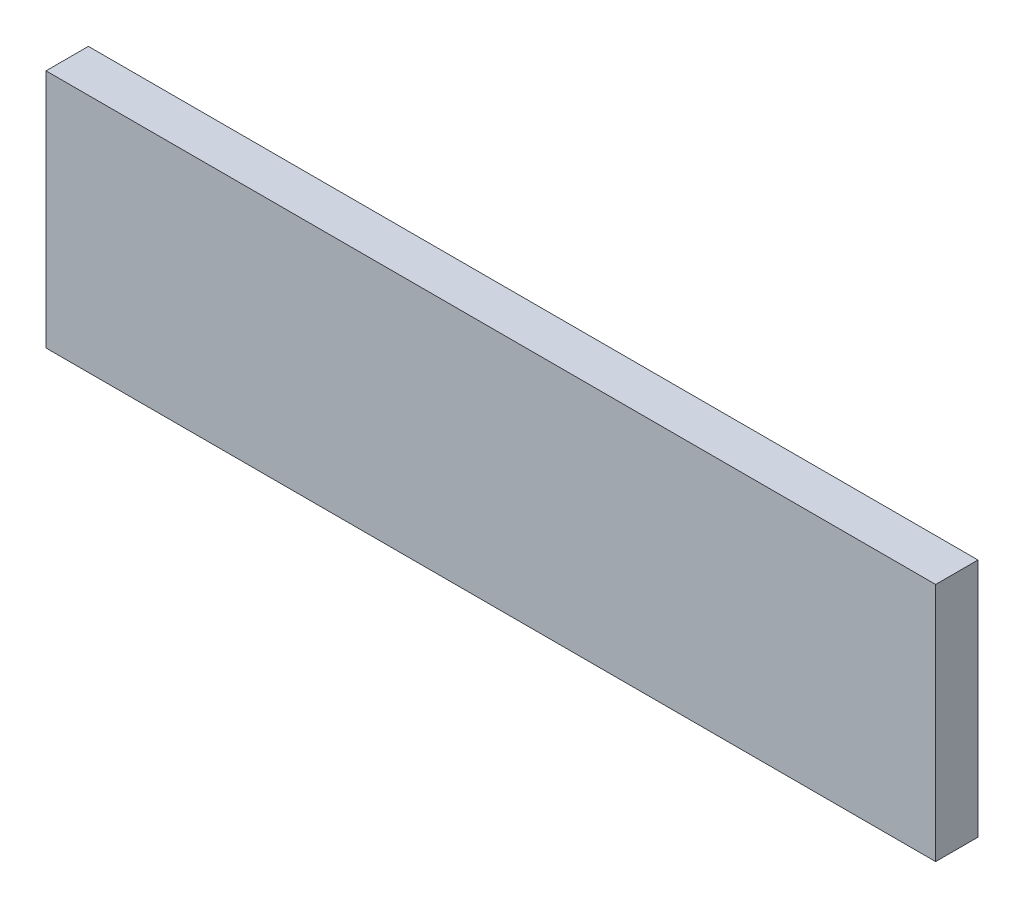
ISO-10303-21;
HEADER;
FILE_DESCRIPTION(('STEP AP214'),'2;1');
FILE_NAME('part.step','',(''),(''),'','','');
FILE_SCHEMA(('AUTOMOTIVE_DESIGN { 1 0 10303 214 1 1 1 1 }'));
ENDSEC;
DATA;
#1=APPLICATION_CONTEXT('core data for automotive mechanical design processes');
#2=APPLICATION_PROTOCOL_DEFINITION('international standard','automotive_design',2000,#1);
#3=PRODUCT_CONTEXT('',#1,'mechanical');
#4=PRODUCT('Part','Part','',(#3));
#5=PRODUCT_RELATED_PRODUCT_CATEGORY('part','',(#4));
#6=PRODUCT_DEFINITION_FORMATION('','',#4);
#7=PRODUCT_DEFINITION_CONTEXT('part definition',#1,'design');
#8=PRODUCT_DEFINITION('design','',#6,#7);
#9=PRODUCT_DEFINITION_SHAPE('','',#8);
#10=(LENGTH_UNIT() NAMED_UNIT(*) SI_UNIT(.MILLI.,.METRE.));
#11=(NAMED_UNIT(*) PLANE_ANGLE_UNIT() SI_UNIT($,.RADIAN.));
#12=(NAMED_UNIT(*) SI_UNIT($,.STERADIAN.) SOLID_ANGLE_UNIT());
#13=UNCERTAINTY_MEASURE_WITH_UNIT(LENGTH_MEASURE(1.E-05),#10,'distance_accuracy_value','');
#14=(GEOMETRIC_REPRESENTATION_CONTEXT(3) GLOBAL_UNCERTAINTY_ASSIGNED_CONTEXT((#13)) GLOBAL_UNIT_ASSIGNED_CONTEXT((#10,
#11,#12)) REPRESENTATION_CONTEXT('',''));
#15=CARTESIAN_POINT('',(0.,0.,0.));
#16=DIRECTION('',(0.,0.,1.));
#17=DIRECTION('',(1.,0.,0.));
#18=AXIS2_PLACEMENT_3D('',#15,#16,#17);
#19=CARTESIAN_POINT('',(200.025,-53.975,19.05));
#20=DIRECTION('',(-1.,0.,0.));
#21=DIRECTION('',(0.,0.,1.));
#22=AXIS2_PLACEMENT_3D('',#19,#20,#21);
#23=PLANE('',#22);
#24=DIRECTION('',(0.,1.,0.));
#25=VECTOR('',#24,1.);
#26=CARTESIAN_POINT('',(200.025,-53.975,0.));
#27=LINE('',#26,#25);
#28=CARTESIAN_POINT('',(200.025,-53.975,0.));
#29=VERTEX_POINT('',#28);
#30=CARTESIAN_POINT('',(200.025,53.975,0.));
#31=VERTEX_POINT('',#30);
#32=EDGE_CURVE('E107',#29,#31,#27,.T.);
#33=ORIENTED_EDGE('',*,*,#32,.T.);
#34=DIRECTION('',(0.,0.,-1.));
#35=VECTOR('',#34,1.);
#36=CARTESIAN_POINT('',(200.025,53.975,19.05));
#37=LINE('',#36,#35);
#38=CARTESIAN_POINT('',(200.025,53.975,19.05));
#39=VERTEX_POINT('',#38);
#40=EDGE_CURVE('E11',#39,#31,#37,.T.);
#41=ORIENTED_EDGE('',*,*,#40,.F.);
#42=DIRECTION('',(0.,1.,0.));
#43=VECTOR('',#42,1.);
#44=CARTESIAN_POINT('',(200.025,-53.975,19.05));
#45=LINE('',#44,#43);
#46=CARTESIAN_POINT('',(200.025,-53.975,19.05));
#47=VERTEX_POINT('',#46);
#48=EDGE_CURVE('E91',#47,#39,#45,.T.);
#49=ORIENTED_EDGE('',*,*,#48,.F.);
#50=DIRECTION('',(0.,0.,-1.));
#51=VECTOR('',#50,1.);
#52=CARTESIAN_POINT('',(200.025,-53.975,19.05));
#53=LINE('',#52,#51);
#54=EDGE_CURVE('E103',#47,#29,#53,.T.);
#55=ORIENTED_EDGE('',*,*,#54,.T.);
#56=EDGE_LOOP('',(#33,#41,#49,#55));
#57=FACE_BOUND('',#56,.T.);
#58=ADVANCED_FACE('F39',(#57),#23,.F.);
#59=CARTESIAN_POINT('',(-200.025,53.975,19.05));
#60=DIRECTION('',(0.,-1.,0.));
#61=DIRECTION('',(0.,0.,-1.));
#62=AXIS2_PLACEMENT_3D('',#59,#60,#61);
#63=PLANE('',#62);
#64=DIRECTION('',(-1.,0.,0.));
#65=VECTOR('',#64,1.);
#66=CARTESIAN_POINT('',(-200.025,53.975,0.));
#67=LINE('',#66,#65);
#68=CARTESIAN_POINT('',(-200.025,53.975,0.));
#69=VERTEX_POINT('',#68);
#70=EDGE_CURVE('E96',#31,#69,#67,.T.);
#71=ORIENTED_EDGE('',*,*,#70,.T.);
#72=DIRECTION('',(0.,0.,-1.));
#73=VECTOR('',#72,1.);
#74=CARTESIAN_POINT('',(-200.025,53.975,19.05));
#75=LINE('',#74,#73);
#76=CARTESIAN_POINT('',(-200.025,53.975,19.05));
#77=VERTEX_POINT('',#76);
#78=EDGE_CURVE('E48',#77,#69,#75,.T.);
#79=ORIENTED_EDGE('',*,*,#78,.F.);
#80=DIRECTION('',(-1.,0.,0.));
#81=VECTOR('',#80,1.);
#82=CARTESIAN_POINT('',(-200.025,53.975,19.05));
#83=LINE('',#82,#81);
#84=EDGE_CURVE('E86',#39,#77,#83,.T.);
#85=ORIENTED_EDGE('',*,*,#84,.F.);
#86=ORIENTED_EDGE('',*,*,#40,.T.);
#87=EDGE_LOOP('',(#71,#79,#85,#86));
#88=FACE_BOUND('',#87,.T.);
#89=ADVANCED_FACE('F95',(#88),#63,.F.);
#90=CARTESIAN_POINT('',(-200.025,-53.975,19.05));
#91=DIRECTION('',(1.,0.,0.));
#92=DIRECTION('',(0.,0.,-1.));
#93=AXIS2_PLACEMENT_3D('',#90,#91,#92);
#94=PLANE('',#93);
#95=DIRECTION('',(0.,-1.,0.));
#96=VECTOR('',#95,1.);
#97=CARTESIAN_POINT('',(-200.025,-53.975,0.));
#98=LINE('',#97,#96);
#99=CARTESIAN_POINT('',(-200.025,-53.975,0.));
#100=VERTEX_POINT('',#99);
#101=EDGE_CURVE('E73',#69,#100,#98,.T.);
#102=ORIENTED_EDGE('',*,*,#101,.T.);
#103=DIRECTION('',(0.,0.,-1.));
#104=VECTOR('',#103,1.);
#105=CARTESIAN_POINT('',(-200.025,-53.975,19.05));
#106=LINE('',#105,#104);
#107=CARTESIAN_POINT('',(-200.025,-53.975,19.05));
#108=VERTEX_POINT('',#107);
#109=EDGE_CURVE('E98',#108,#100,#106,.T.);
#110=ORIENTED_EDGE('',*,*,#109,.F.);
#111=DIRECTION('',(0.,-1.,0.));
#112=VECTOR('',#111,1.);
#113=CARTESIAN_POINT('',(-200.025,-53.975,19.05));
#114=LINE('',#113,#112);
#115=EDGE_CURVE('E89',#77,#108,#114,.T.);
#116=ORIENTED_EDGE('',*,*,#115,.F.);
#117=ORIENTED_EDGE('',*,*,#78,.T.);
#118=EDGE_LOOP('',(#102,#110,#116,#117));
#119=FACE_BOUND('',#118,.T.);
#120=ADVANCED_FACE('F99',(#119),#94,.F.);
#121=CARTESIAN_POINT('',(-200.025,-53.975,19.05));
#122=DIRECTION('',(0.,1.,0.));
#123=DIRECTION('',(0.,0.,1.));
#124=AXIS2_PLACEMENT_3D('',#121,#122,#123);
#125=PLANE('',#124);
#126=DIRECTION('',(1.,0.,0.));
#127=VECTOR('',#126,1.);
#128=CARTESIAN_POINT('',(-200.025,-53.975,0.));
#129=LINE('',#128,#127);
#130=EDGE_CURVE('E79',#100,#29,#129,.T.);
#131=ORIENTED_EDGE('',*,*,#130,.T.);
#132=ORIENTED_EDGE('',*,*,#54,.F.);
#133=DIRECTION('',(1.,0.,0.));
#134=VECTOR('',#133,1.);
#135=CARTESIAN_POINT('',(-200.025,-53.975,19.05));
#136=LINE('',#135,#134);
#137=EDGE_CURVE('E56',#108,#47,#136,.T.);
#138=ORIENTED_EDGE('',*,*,#137,.F.);
#139=ORIENTED_EDGE('',*,*,#109,.T.);
#140=EDGE_LOOP('',(#131,#132,#138,#139));
#141=FACE_BOUND('',#140,.T.);
#142=ADVANCED_FACE('F120',(#141),#125,.F.);
#143=CARTESIAN_POINT('',(0.,0.,19.05));
#144=DIRECTION('',(0.,0.,-1.));
#145=DIRECTION('',(-1.,0.,0.));
#146=AXIS2_PLACEMENT_3D('',#143,#144,#145);
#147=PLANE('',#146);
#148=ORIENTED_EDGE('',*,*,#48,.T.);
#149=ORIENTED_EDGE('',*,*,#84,.T.);
#150=ORIENTED_EDGE('',*,*,#115,.T.);
#151=ORIENTED_EDGE('',*,*,#137,.T.);
#152=EDGE_LOOP('',(#148,#149,#150,#151));
#153=FACE_BOUND('',#152,.T.);
#154=ADVANCED_FACE('F87',(#153),#147,.F.);
#155=CARTESIAN_POINT('',(0.,0.,0.));
#156=DIRECTION('',(0.,0.,-1.));
#157=DIRECTION('',(-1.,0.,0.));
#158=AXIS2_PLACEMENT_3D('',#155,#156,#157);
#159=PLANE('',#158);
#160=ORIENTED_EDGE('',*,*,#32,.F.);
#161=ORIENTED_EDGE('',*,*,#130,.F.);
#162=ORIENTED_EDGE('',*,*,#101,.F.);
#163=ORIENTED_EDGE('',*,*,#70,.F.);
#164=EDGE_LOOP('',(#160,#161,#162,#163));
#165=FACE_BOUND('',#164,.T.);
#166=ADVANCED_FACE('F123',(#165),#159,.T.);
#167=CLOSED_SHELL('',(#58,#89,#120,#142,#154,#166));
#168=MANIFOLD_SOLID_BREP('B2',#167);
#169=ADVANCED_BREP_SHAPE_REPRESENTATION('',(#18,#168),#14);
#170=SHAPE_DEFINITION_REPRESENTATION(#9,#169);
ENDSEC;
END-ISO-10303-21;
